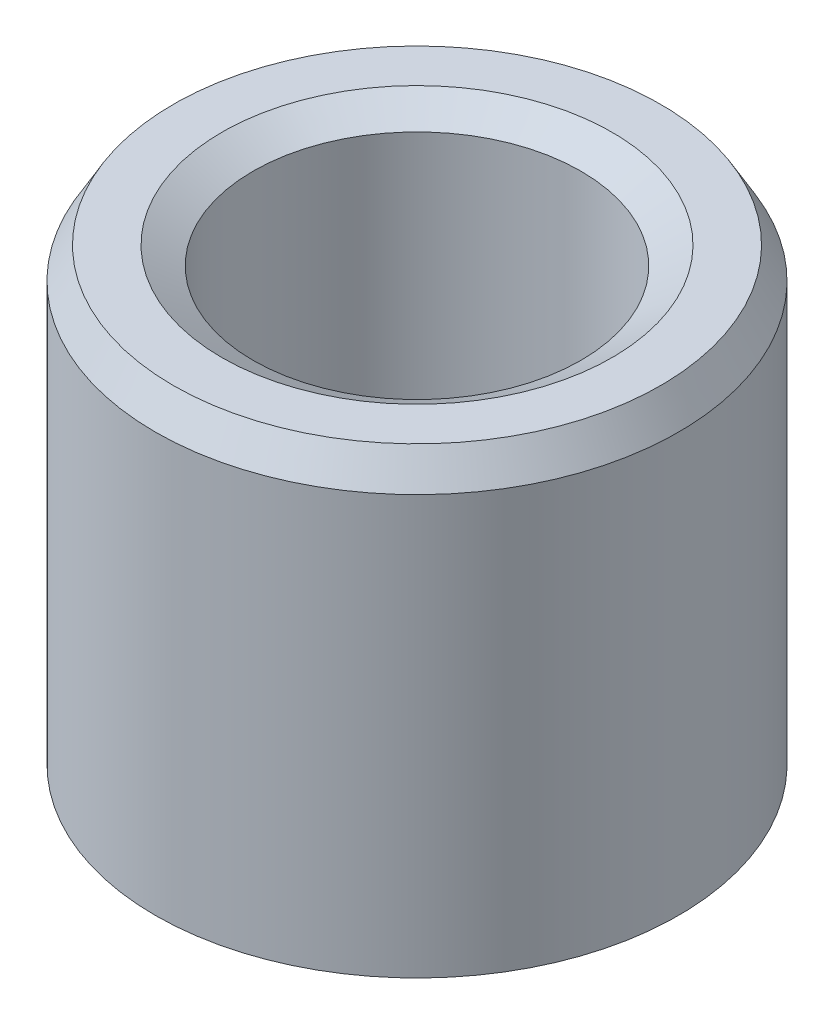
ISO-10303-21;
HEADER;
FILE_DESCRIPTION(('STEP AP214'),'2;1');
FILE_NAME('part.step','',(''),(''),'','','');
FILE_SCHEMA(('AUTOMOTIVE_DESIGN { 1 0 10303 214 1 1 1 1 }'));
ENDSEC;
DATA;
#1=APPLICATION_CONTEXT('core data for automotive mechanical design processes');
#2=APPLICATION_PROTOCOL_DEFINITION('international standard','automotive_design',2000,#1);
#3=PRODUCT_CONTEXT('',#1,'mechanical');
#4=PRODUCT('Part','Part','',(#3));
#5=PRODUCT_RELATED_PRODUCT_CATEGORY('part','',(#4));
#6=PRODUCT_DEFINITION_FORMATION('','',#4);
#7=PRODUCT_DEFINITION_CONTEXT('part definition',#1,'design');
#8=PRODUCT_DEFINITION('design','',#6,#7);
#9=PRODUCT_DEFINITION_SHAPE('','',#8);
#10=(LENGTH_UNIT() NAMED_UNIT(*) SI_UNIT(.MILLI.,.METRE.));
#11=(NAMED_UNIT(*) PLANE_ANGLE_UNIT() SI_UNIT($,.RADIAN.));
#12=(NAMED_UNIT(*) SI_UNIT($,.STERADIAN.) SOLID_ANGLE_UNIT());
#13=UNCERTAINTY_MEASURE_WITH_UNIT(LENGTH_MEASURE(1.E-05),#10,'distance_accuracy_value','');
#14=(GEOMETRIC_REPRESENTATION_CONTEXT(3) GLOBAL_UNCERTAINTY_ASSIGNED_CONTEXT((#13)) GLOBAL_UNIT_ASSIGNED_CONTEXT((#10,
#11,#12)) REPRESENTATION_CONTEXT('',''));
#15=CARTESIAN_POINT('',(0.,0.,0.));
#16=DIRECTION('',(0.,0.,1.));
#17=DIRECTION('',(1.,0.,0.));
#18=AXIS2_PLACEMENT_3D('',#15,#16,#17);
#19=CARTESIAN_POINT('',(0.,13.4106406031398,0.));
#20=DIRECTION('',(0.,-1.,0.));
#21=DIRECTION('',(0.,0.,-1.));
#22=AXIS2_PLACEMENT_3D('',#19,#20,#21);
#23=CYLINDRICAL_SURFACE('',#22,7.5);
#24=CARTESIAN_POINT('',(0.,0.517077372549878,0.));
#25=DIRECTION('',(0.,1.,0.));
#26=DIRECTION('',(0.,0.,1.));
#27=AXIS2_PLACEMENT_3D('',#24,#25,#26);
#28=CIRCLE('',#27,7.5);
#29=CARTESIAN_POINT('',(0.,0.517077372549878,7.5));
#30=VERTEX_POINT('',#29);
#31=EDGE_CURVE('E10',#30,#30,#28,.T.);
#32=ORIENTED_EDGE('',*,*,#31,.T.);
#33=EDGE_LOOP('',(#32));
#34=FACE_BOUND('',#33,.T.);
#35=CARTESIAN_POINT('',(0.,12.5150363224391,0.));
#36=DIRECTION('',(0.,1.,0.));
#37=DIRECTION('',(0.,0.,1.));
#38=AXIS2_PLACEMENT_3D('',#35,#36,#37);
#39=CIRCLE('',#38,7.5);
#40=CARTESIAN_POINT('',(0.,12.5150363224391,7.5));
#41=VERTEX_POINT('',#40);
#42=EDGE_CURVE('E50',#41,#41,#39,.F.);
#43=ORIENTED_EDGE('',*,*,#42,.T.);
#44=EDGE_LOOP('',(#43));
#45=FACE_BOUND('',#44,.T.);
#46=ADVANCED_FACE('F39',(#34,#45),#23,.T.);
#47=CARTESIAN_POINT('',(0.,13.4106406031398,0.));
#48=DIRECTION('',(0.,1.,0.));
#49=DIRECTION('',(0.,0.,1.));
#50=AXIS2_PLACEMENT_3D('',#47,#48,#49);
#51=PLANE('',#50);
#52=CARTESIAN_POINT('',(0.,13.4106406031398,0.));
#53=DIRECTION('',(0.,1.,0.));
#54=DIRECTION('',(0.,0.,1.));
#55=AXIS2_PLACEMENT_3D('',#52,#53,#54);
#56=CIRCLE('',#55,5.59380611703705);
#57=CARTESIAN_POINT('',(0.,13.4106406031398,5.59380611703705));
#58=VERTEX_POINT('',#57);
#59=EDGE_CURVE('E58',#58,#58,#56,.F.);
#60=ORIENTED_EDGE('',*,*,#59,.T.);
#61=EDGE_LOOP('',(#60));
#62=FACE_BOUND('',#61,.T.);
#63=CARTESIAN_POINT('',(0.,13.4106406031398,0.));
#64=DIRECTION('',(0.,1.,0.));
#65=DIRECTION('',(0.,0.,1.));
#66=AXIS2_PLACEMENT_3D('',#63,#64,#65);
#67=CIRCLE('',#66,6.98292262745012);
#68=CARTESIAN_POINT('',(0.,13.4106406031398,6.98292262745012));
#69=VERTEX_POINT('',#68);
#70=EDGE_CURVE('E61',#69,#69,#67,.T.);
#71=ORIENTED_EDGE('',*,*,#70,.T.);
#72=EDGE_LOOP('',(#71));
#73=FACE_BOUND('',#72,.T.);
#74=ADVANCED_FACE('F88',(#62,#73),#51,.T.);
#75=CARTESIAN_POINT('',(0.,0.,0.));
#76=DIRECTION('',(0.,1.,0.));
#77=DIRECTION('',(0.,0.,1.));
#78=AXIS2_PLACEMENT_3D('',#75,#76,#77);
#79=PLANE('',#78);
#80=CARTESIAN_POINT('',(0.,0.,0.));
#81=DIRECTION('',(0.,1.,0.));
#82=DIRECTION('',(0.,0.,1.));
#83=AXIS2_PLACEMENT_3D('',#80,#81,#82);
#84=CIRCLE('',#83,5.21527920888632);
#85=CARTESIAN_POINT('',(0.,0.,5.21527920888632));
#86=VERTEX_POINT('',#85);
#87=EDGE_CURVE('E51',#86,#86,#84,.T.);
#88=ORIENTED_EDGE('',*,*,#87,.T.);
#89=EDGE_LOOP('',(#88));
#90=FACE_BOUND('',#89,.T.);
#91=CARTESIAN_POINT('',(0.,0.,0.));
#92=DIRECTION('',(0.,1.,0.));
#93=DIRECTION('',(0.,0.,1.));
#94=AXIS2_PLACEMENT_3D('',#91,#92,#93);
#95=CIRCLE('',#94,6.60439571929938);
#96=CARTESIAN_POINT('',(0.,0.,6.60439571929938));
#97=VERTEX_POINT('',#96);
#98=EDGE_CURVE('E54',#97,#97,#95,.F.);
#99=ORIENTED_EDGE('',*,*,#98,.T.);
#100=EDGE_LOOP('',(#99));
#101=FACE_BOUND('',#100,.T.);
#102=ADVANCED_FACE('F83',(#90,#101),#79,.F.);
#103=CARTESIAN_POINT('',(0.,13.4106406031398,0.));
#104=DIRECTION('',(0.,-1.,0.));
#105=DIRECTION('',(0.,0.,-1.));
#106=AXIS2_PLACEMENT_3D('',#103,#104,#105);
#107=CYLINDRICAL_SURFACE('',#106,4.69820183633644);
#108=CARTESIAN_POINT('',(0.,12.8935632305899,0.));
#109=DIRECTION('',(0.,1.,0.));
#110=DIRECTION('',(0.,0.,1.));
#111=AXIS2_PLACEMENT_3D('',#108,#109,#110);
#112=CIRCLE('',#111,4.69820183633644);
#113=CARTESIAN_POINT('',(0.,12.8935632305899,4.69820183633644));
#114=VERTEX_POINT('',#113);
#115=EDGE_CURVE('E67',#114,#114,#112,.T.);
#116=ORIENTED_EDGE('',*,*,#115,.T.);
#117=EDGE_LOOP('',(#116));
#118=FACE_BOUND('',#117,.T.);
#119=CARTESIAN_POINT('',(0.,0.895604280700624,0.));
#120=DIRECTION('',(0.,1.,0.));
#121=DIRECTION('',(0.,0.,1.));
#122=AXIS2_PLACEMENT_3D('',#119,#120,#121);
#123=CIRCLE('',#122,4.69820183633644);
#124=CARTESIAN_POINT('',(0.,0.895604280700624,4.69820183633644));
#125=VERTEX_POINT('',#124);
#126=EDGE_CURVE('E69',#125,#125,#123,.F.);
#127=ORIENTED_EDGE('',*,*,#126,.T.);
#128=EDGE_LOOP('',(#127));
#129=FACE_BOUND('',#128,.T.);
#130=ADVANCED_FACE('F71',(#118,#129),#107,.F.);
#131=CARTESIAN_POINT('',(0.,12.8935632305899,0.));
#132=DIRECTION('',(0.,1.,0.));
#133=DIRECTION('',(0.,0.,1.));
#134=AXIS2_PLACEMENT_3D('',#131,#132,#133);
#135=CONICAL_SURFACE('',#134,4.69820183633644,1.0471975511966);
#136=ORIENTED_EDGE('',*,*,#59,.F.);
#137=EDGE_LOOP('',(#136));
#138=FACE_BOUND('',#137,.T.);
#139=ORIENTED_EDGE('',*,*,#115,.F.);
#140=EDGE_LOOP('',(#139));
#141=FACE_BOUND('',#140,.T.);
#142=ADVANCED_FACE('F77',(#138,#141),#135,.F.);
#143=CARTESIAN_POINT('',(0.,0.,0.));
#144=DIRECTION('',(0.,-1.,0.));
#145=DIRECTION('',(0.,0.,-1.));
#146=AXIS2_PLACEMENT_3D('',#143,#144,#145);
#147=CONICAL_SURFACE('',#146,5.21527920888632,0.523598775598295);
#148=ORIENTED_EDGE('',*,*,#126,.F.);
#149=EDGE_LOOP('',(#148));
#150=FACE_BOUND('',#149,.T.);
#151=ORIENTED_EDGE('',*,*,#87,.F.);
#152=EDGE_LOOP('',(#151));
#153=FACE_BOUND('',#152,.T.);
#154=ADVANCED_FACE('F73',(#150,#153),#147,.F.);
#155=CARTESIAN_POINT('',(0.,0.517077372549878,0.));
#156=DIRECTION('',(0.,1.,0.));
#157=DIRECTION('',(0.,0.,1.));
#158=AXIS2_PLACEMENT_3D('',#155,#156,#157);
#159=CONICAL_SURFACE('',#158,7.5,1.0471975511966);
#160=ORIENTED_EDGE('',*,*,#98,.F.);
#161=EDGE_LOOP('',(#160));
#162=FACE_BOUND('',#161,.T.);
#163=ORIENTED_EDGE('',*,*,#31,.F.);
#164=EDGE_LOOP('',(#163));
#165=FACE_BOUND('',#164,.T.);
#166=ADVANCED_FACE('F76',(#162,#165),#159,.T.);
#167=CARTESIAN_POINT('',(0.,13.4106406031398,0.));
#168=DIRECTION('',(0.,-1.,0.));
#169=DIRECTION('',(0.,0.,-1.));
#170=AXIS2_PLACEMENT_3D('',#167,#168,#169);
#171=CONICAL_SURFACE('',#170,6.98292262745012,0.523598775598293);
#172=ORIENTED_EDGE('',*,*,#42,.F.);
#173=EDGE_LOOP('',(#172));
#174=FACE_BOUND('',#173,.T.);
#175=ORIENTED_EDGE('',*,*,#70,.F.);
#176=EDGE_LOOP('',(#175));
#177=FACE_BOUND('',#176,.T.);
#178=ADVANCED_FACE('F45',(#174,#177),#171,.T.);
#179=CLOSED_SHELL('',(#46,#74,#102,#130,#142,#154,#166,#178));
#180=MANIFOLD_SOLID_BREP('B2',#179);
#181=ADVANCED_BREP_SHAPE_REPRESENTATION('',(#18,#180),#14);
#182=SHAPE_DEFINITION_REPRESENTATION(#9,#181);
ENDSEC;
END-ISO-10303-21;
